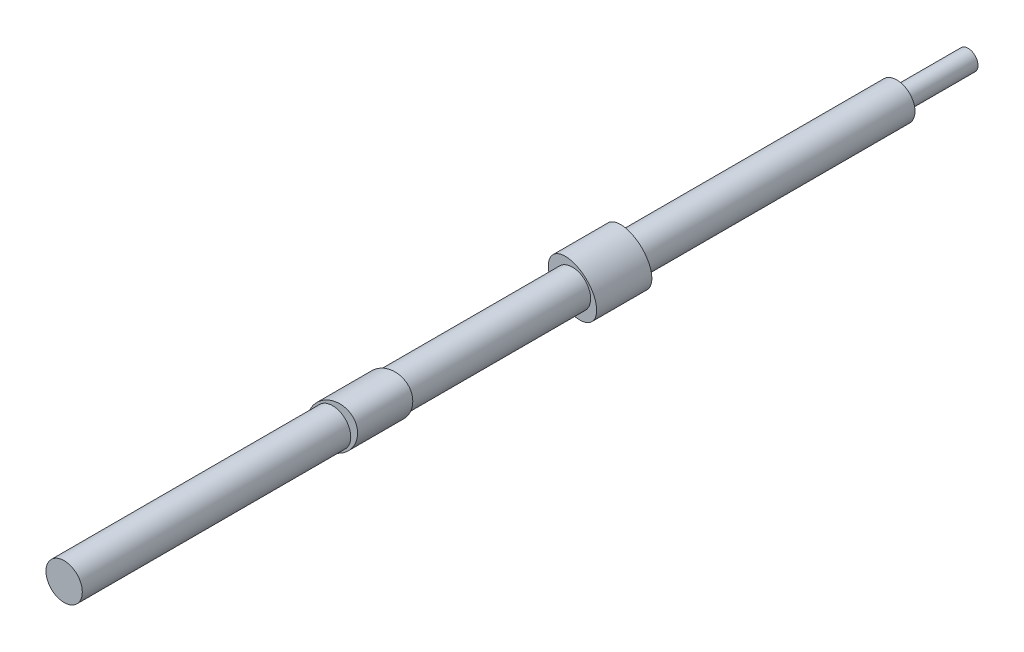
ISO-10303-21;
HEADER;
FILE_DESCRIPTION(('STEP AP214'),'2;1');
FILE_NAME('part.step','',(''),(''),'','','');
FILE_SCHEMA(('AUTOMOTIVE_DESIGN { 1 0 10303 214 1 1 1 1 }'));
ENDSEC;
DATA;
#1=APPLICATION_CONTEXT('core data for automotive mechanical design processes');
#2=APPLICATION_PROTOCOL_DEFINITION('international standard','automotive_design',2000,#1);
#3=PRODUCT_CONTEXT('',#1,'mechanical');
#4=PRODUCT('Part','Part','',(#3));
#5=PRODUCT_RELATED_PRODUCT_CATEGORY('part','',(#4));
#6=PRODUCT_DEFINITION_FORMATION('','',#4);
#7=PRODUCT_DEFINITION_CONTEXT('part definition',#1,'design');
#8=PRODUCT_DEFINITION('design','',#6,#7);
#9=PRODUCT_DEFINITION_SHAPE('','',#8);
#10=(LENGTH_UNIT() NAMED_UNIT(*) SI_UNIT(.MILLI.,.METRE.));
#11=(NAMED_UNIT(*) PLANE_ANGLE_UNIT() SI_UNIT($,.RADIAN.));
#12=(NAMED_UNIT(*) SI_UNIT($,.STERADIAN.) SOLID_ANGLE_UNIT());
#13=UNCERTAINTY_MEASURE_WITH_UNIT(LENGTH_MEASURE(1.E-05),#10,'distance_accuracy_value','');
#14=(GEOMETRIC_REPRESENTATION_CONTEXT(3) GLOBAL_UNCERTAINTY_ASSIGNED_CONTEXT((#13)) GLOBAL_UNIT_ASSIGNED_CONTEXT((#10,
#11,#12)) REPRESENTATION_CONTEXT('',''));
#15=CARTESIAN_POINT('',(0.,0.,0.));
#16=DIRECTION('',(0.,0.,1.));
#17=DIRECTION('',(1.,0.,0.));
#18=AXIS2_PLACEMENT_3D('',#15,#16,#17);
#19=CARTESIAN_POINT('',(0.,0.,90.5000000000001));
#20=DIRECTION('',(0.,0.,-1.));
#21=DIRECTION('',(-1.,0.,0.));
#22=AXIS2_PLACEMENT_3D('',#19,#20,#21);
#23=CYLINDRICAL_SURFACE('',#22,3.9498302938567);
#24=CARTESIAN_POINT('',(0.,0.,32.14365475));
#25=DIRECTION('',(0.,0.,1.));
#26=DIRECTION('',(1.,0.,0.));
#27=AXIS2_PLACEMENT_3D('',#24,#25,#26);
#28=CIRCLE('',#27,3.9498302938567);
#29=CARTESIAN_POINT('',(3.9498302938567,0.,32.14365475));
#30=VERTEX_POINT('',#29);
#31=EDGE_CURVE('E52',#30,#30,#28,.T.);
#32=ORIENTED_EDGE('',*,*,#31,.T.);
#33=EDGE_LOOP('',(#32));
#34=FACE_BOUND('',#33,.T.);
#35=CARTESIAN_POINT('',(0.,0.,90.5000000000001));
#36=DIRECTION('',(0.,0.,1.));
#37=DIRECTION('',(1.,0.,0.));
#38=AXIS2_PLACEMENT_3D('',#35,#36,#37);
#39=CIRCLE('',#38,3.9498302938567);
#40=CARTESIAN_POINT('',(3.9498302938567,0.,90.5000000000001));
#41=VERTEX_POINT('',#40);
#42=EDGE_CURVE('E49',#41,#41,#39,.T.);
#43=ORIENTED_EDGE('',*,*,#42,.F.);
#44=EDGE_LOOP('',(#43));
#45=FACE_BOUND('',#44,.T.);
#46=ADVANCED_FACE('F34',(#34,#45),#23,.T.);
#47=CARTESIAN_POINT('',(0.,0.,90.5000000000001));
#48=DIRECTION('',(0.,0.,1.));
#49=DIRECTION('',(1.,0.,0.));
#50=AXIS2_PLACEMENT_3D('',#47,#48,#49);
#51=PLANE('',#50);
#52=ORIENTED_EDGE('',*,*,#42,.T.);
#53=EDGE_LOOP('',(#52));
#54=FACE_BOUND('',#53,.T.);
#55=ADVANCED_FACE('F94',(#54),#51,.T.);
#56=CARTESIAN_POINT('',(0.,0.,32.14365475));
#57=DIRECTION('',(0.,0.,1.));
#58=DIRECTION('',(0.782305841020066,0.622894510415598,0.));
#59=AXIS2_PLACEMENT_3D('',#56,#57,#58);
#60=ELLIPSE('',#59,5.99273516987387,4.41265556955307);
#61=DIRECTION('',(0.,0.,-1.));
#62=VECTOR('',#61,1.);
#63=SURFACE_OF_LINEAR_EXTRUSION('',#60,#62);
#64=CARTESIAN_POINT('',(4.6881517270787,3.73284183968892,32.14365475));
#65=VERTEX_POINT('',#64);
#66=EDGE_CURVE('E60',#65,#65,#60,.T.);
#67=ORIENTED_EDGE('',*,*,#66,.F.);
#68=EDGE_LOOP('',(#67));
#69=FACE_BOUND('',#68,.T.);
#70=CARTESIAN_POINT('',(0.,0.,20.14365475));
#71=DIRECTION('',(0.,0.,1.));
#72=DIRECTION('',(0.782305841020066,0.622894510415598,0.));
#73=AXIS2_PLACEMENT_3D('',#70,#71,#72);
#74=ELLIPSE('',#73,5.99273516987387,4.41265556955307);
#75=CARTESIAN_POINT('',(4.6881517270787,3.73284183968892,20.14365475));
#76=VERTEX_POINT('',#75);
#77=EDGE_CURVE('E55',#76,#76,#74,.T.);
#78=ORIENTED_EDGE('',*,*,#77,.T.);
#79=EDGE_LOOP('',(#78));
#80=FACE_BOUND('',#79,.T.);
#81=ADVANCED_FACE('F87',(#69,#80),#63,.F.);
#82=CARTESIAN_POINT('',(0.,0.,32.14365475));
#83=DIRECTION('',(0.,0.,1.));
#84=DIRECTION('',(1.,0.,0.));
#85=AXIS2_PLACEMENT_3D('',#82,#83,#84);
#86=PLANE('',#85);
#87=ORIENTED_EDGE('',*,*,#31,.F.);
#88=EDGE_LOOP('',(#87));
#89=FACE_BOUND('',#88,.T.);
#90=ORIENTED_EDGE('',*,*,#66,.T.);
#91=EDGE_LOOP('',(#90));
#92=FACE_BOUND('',#91,.T.);
#93=ADVANCED_FACE('F83',(#89,#92),#86,.T.);
#94=CARTESIAN_POINT('',(0.,0.,20.14365475));
#95=DIRECTION('',(0.,0.,1.));
#96=DIRECTION('',(1.,0.,0.));
#97=AXIS2_PLACEMENT_3D('',#94,#95,#96);
#98=PLANE('',#97);
#99=CARTESIAN_POINT('',(0.,0.,20.14365475));
#100=DIRECTION('',(0.,0.,1.));
#101=DIRECTION('',(1.,0.,0.));
#102=AXIS2_PLACEMENT_3D('',#99,#100,#101);
#103=CIRCLE('',#102,3.9498302938567);
#104=CARTESIAN_POINT('',(3.9498302938567,0.,20.14365475));
#105=VERTEX_POINT('',#104);
#106=EDGE_CURVE('E44',#105,#105,#103,.T.);
#107=ORIENTED_EDGE('',*,*,#106,.T.);
#108=EDGE_LOOP('',(#107));
#109=FACE_BOUND('',#108,.T.);
#110=ORIENTED_EDGE('',*,*,#77,.F.);
#111=EDGE_LOOP('',(#110));
#112=FACE_BOUND('',#111,.T.);
#113=ADVANCED_FACE('F86',(#109,#112),#98,.F.);
#114=CARTESIAN_POINT('',(0.,0.,-20.));
#115=DIRECTION('',(0.,0.,1.));
#116=DIRECTION('',(1.,0.,0.));
#117=AXIS2_PLACEMENT_3D('',#114,#115,#116);
#118=CIRCLE('',#117,3.9498302938567);
#119=CARTESIAN_POINT('',(3.9498302938567,0.,-20.));
#120=VERTEX_POINT('',#119);
#121=EDGE_CURVE('E53',#120,#120,#118,.T.);
#122=ORIENTED_EDGE('',*,*,#121,.T.);
#123=EDGE_LOOP('',(#122));
#124=FACE_BOUND('',#123,.T.);
#125=ORIENTED_EDGE('',*,*,#106,.F.);
#126=EDGE_LOOP('',(#125));
#127=FACE_BOUND('',#126,.T.);
#128=ADVANCED_FACE('F79',(#124,#127),#23,.T.);
#129=CARTESIAN_POINT('',(0.,0.,-20.));
#130=DIRECTION('',(0.,0.,1.));
#131=DIRECTION('',(-0.714989058326736,0.699135642399276,0.));
#132=AXIS2_PLACEMENT_3D('',#129,#130,#131);
#133=ELLIPSE('',#132,5.95772431747193,4.39157601907806);
#134=DIRECTION('',(0.,0.,-1.));
#135=VECTOR('',#134,1.);
#136=SURFACE_OF_LINEAR_EXTRUSION('',#133,#135);
#137=CARTESIAN_POINT('',(-4.25970769951955,4.16525741793352,-20.));
#138=VERTEX_POINT('',#137);
#139=EDGE_CURVE('E56',#138,#138,#133,.T.);
#140=ORIENTED_EDGE('',*,*,#139,.F.);
#141=EDGE_LOOP('',(#140));
#142=FACE_BOUND('',#141,.T.);
#143=CARTESIAN_POINT('',(0.,0.,-32.));
#144=DIRECTION('',(0.,0.,1.));
#145=DIRECTION('',(-0.714989058326736,0.699135642399276,0.));
#146=AXIS2_PLACEMENT_3D('',#143,#144,#145);
#147=ELLIPSE('',#146,5.95772431747193,4.39157601907806);
#148=CARTESIAN_POINT('',(-4.25970769951955,4.16525741793352,-32.));
#149=VERTEX_POINT('',#148);
#150=EDGE_CURVE('E63',#149,#149,#147,.T.);
#151=ORIENTED_EDGE('',*,*,#150,.T.);
#152=EDGE_LOOP('',(#151));
#153=FACE_BOUND('',#152,.T.);
#154=ADVANCED_FACE('F74',(#142,#153),#136,.F.);
#155=CARTESIAN_POINT('',(0.,0.,-20.));
#156=DIRECTION('',(0.,0.,1.));
#157=DIRECTION('',(1.,0.,0.));
#158=AXIS2_PLACEMENT_3D('',#155,#156,#157);
#159=PLANE('',#158);
#160=ORIENTED_EDGE('',*,*,#121,.F.);
#161=EDGE_LOOP('',(#160));
#162=FACE_BOUND('',#161,.T.);
#163=ORIENTED_EDGE('',*,*,#139,.T.);
#164=EDGE_LOOP('',(#163));
#165=FACE_BOUND('',#164,.T.);
#166=ADVANCED_FACE('F78',(#162,#165),#159,.T.);
#167=CARTESIAN_POINT('',(0.,0.,-32.));
#168=DIRECTION('',(0.,0.,1.));
#169=DIRECTION('',(1.,0.,0.));
#170=AXIS2_PLACEMENT_3D('',#167,#168,#169);
#171=PLANE('',#170);
#172=CARTESIAN_POINT('',(0.,0.,-32.));
#173=DIRECTION('',(0.,0.,1.));
#174=DIRECTION('',(1.,0.,0.));
#175=AXIS2_PLACEMENT_3D('',#172,#173,#174);
#176=CIRCLE('',#175,3.9498302938567);
#177=CARTESIAN_POINT('',(3.9498302938567,0.,-32.));
#178=VERTEX_POINT('',#177);
#179=EDGE_CURVE('E40',#178,#178,#176,.T.);
#180=ORIENTED_EDGE('',*,*,#179,.T.);
#181=EDGE_LOOP('',(#180));
#182=FACE_BOUND('',#181,.T.);
#183=ORIENTED_EDGE('',*,*,#150,.F.);
#184=EDGE_LOOP('',(#183));
#185=FACE_BOUND('',#184,.T.);
#186=ADVANCED_FACE('F81',(#182,#185),#171,.F.);
#187=CARTESIAN_POINT('',(0.,0.,-90.5000000000001));
#188=DIRECTION('',(0.,0.,1.));
#189=DIRECTION('',(1.,0.,0.));
#190=AXIS2_PLACEMENT_3D('',#187,#188,#189);
#191=PLANE('',#190);
#192=CARTESIAN_POINT('',(0.,0.,-90.5000000000001));
#193=DIRECTION('',(0.,0.,1.));
#194=DIRECTION('',(1.,0.,0.));
#195=AXIS2_PLACEMENT_3D('',#192,#193,#194);
#196=CIRCLE('',#195,2.15257979396775);
#197=CARTESIAN_POINT('',(2.15257979396775,0.,-90.5000000000001));
#198=VERTEX_POINT('',#197);
#199=EDGE_CURVE('E10',#198,#198,#196,.F.);
#200=ORIENTED_EDGE('',*,*,#199,.F.);
#201=EDGE_LOOP('',(#200));
#202=FACE_BOUND('',#201,.T.);
#203=CARTESIAN_POINT('',(0.,0.,-90.5000000000001));
#204=DIRECTION('',(0.,0.,1.));
#205=DIRECTION('',(1.,0.,0.));
#206=AXIS2_PLACEMENT_3D('',#203,#204,#205);
#207=CIRCLE('',#206,3.9498302938567);
#208=CARTESIAN_POINT('',(3.9498302938567,0.,-90.5000000000001));
#209=VERTEX_POINT('',#208);
#210=EDGE_CURVE('E101',#209,#209,#207,.T.);
#211=ORIENTED_EDGE('',*,*,#210,.F.);
#212=EDGE_LOOP('',(#211));
#213=FACE_BOUND('',#212,.T.);
#214=ADVANCED_FACE('F156',(#202,#213),#191,.F.);
#215=ORIENTED_EDGE('',*,*,#210,.T.);
#216=EDGE_LOOP('',(#215));
#217=FACE_BOUND('',#216,.T.);
#218=ORIENTED_EDGE('',*,*,#179,.F.);
#219=EDGE_LOOP('',(#218));
#220=FACE_BOUND('',#219,.T.);
#221=ADVANCED_FACE('F115',(#217,#220),#23,.T.);
#222=CARTESIAN_POINT('',(0.,0.,-106.));
#223=DIRECTION('',(0.,0.,1.));
#224=DIRECTION('',(1.,0.,0.));
#225=AXIS2_PLACEMENT_3D('',#222,#223,#224);
#226=CYLINDRICAL_SURFACE('',#225,2.15257979396775);
#227=CARTESIAN_POINT('',(0.,0.,-106.));
#228=DIRECTION('',(0.,0.,-1.));
#229=DIRECTION('',(-1.,0.,0.));
#230=AXIS2_PLACEMENT_3D('',#227,#228,#229);
#231=CIRCLE('',#230,2.15257979396775);
#232=CARTESIAN_POINT('',(-2.15257979396775,0.,-106.));
#233=VERTEX_POINT('',#232);
#234=EDGE_CURVE('E68',#233,#233,#231,.T.);
#235=ORIENTED_EDGE('',*,*,#234,.F.);
#236=EDGE_LOOP('',(#235));
#237=FACE_BOUND('',#236,.T.);
#238=ORIENTED_EDGE('',*,*,#199,.T.);
#239=EDGE_LOOP('',(#238));
#240=FACE_BOUND('',#239,.T.);
#241=ADVANCED_FACE('F169',(#237,#240),#226,.T.);
#242=CARTESIAN_POINT('',(0.,0.,-106.));
#243=DIRECTION('',(0.,0.,-1.));
#244=DIRECTION('',(-1.,0.,0.));
#245=AXIS2_PLACEMENT_3D('',#242,#243,#244);
#246=PLANE('',#245);
#247=ORIENTED_EDGE('',*,*,#234,.T.);
#248=EDGE_LOOP('',(#247));
#249=FACE_BOUND('',#248,.T.);
#250=ADVANCED_FACE('F174',(#249),#246,.T.);
#251=CLOSED_SHELL('',(#46,#55,#81,#93,#113,#128,#154,#166,#186,#214,#221,#241,#250));
#252=MANIFOLD_SOLID_BREP('B2',#251);
#253=ADVANCED_BREP_SHAPE_REPRESENTATION('',(#18,#252),#14);
#254=SHAPE_DEFINITION_REPRESENTATION(#9,#253);
ENDSEC;
END-ISO-10303-21;
